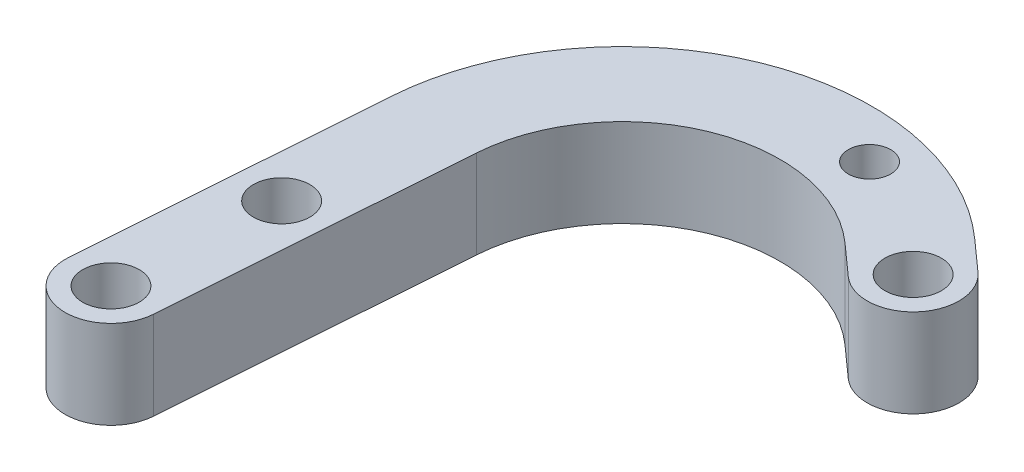
ISO-10303-21;
HEADER;
FILE_DESCRIPTION(('STEP AP214'),'2;1');
FILE_NAME('part.step','',(''),(''),'','','');
FILE_SCHEMA(('AUTOMOTIVE_DESIGN { 1 0 10303 214 1 1 1 1 }'));
ENDSEC;
DATA;
#1=APPLICATION_CONTEXT('core data for automotive mechanical design processes');
#2=APPLICATION_PROTOCOL_DEFINITION('international standard','automotive_design',2000,#1);
#3=PRODUCT_CONTEXT('',#1,'mechanical');
#4=PRODUCT('Part','Part','',(#3));
#5=PRODUCT_RELATED_PRODUCT_CATEGORY('part','',(#4));
#6=PRODUCT_DEFINITION_FORMATION('','',#4);
#7=PRODUCT_DEFINITION_CONTEXT('part definition',#1,'design');
#8=PRODUCT_DEFINITION('design','',#6,#7);
#9=PRODUCT_DEFINITION_SHAPE('','',#8);
#10=(LENGTH_UNIT() NAMED_UNIT(*) SI_UNIT(.MILLI.,.METRE.));
#11=(NAMED_UNIT(*) PLANE_ANGLE_UNIT() SI_UNIT($,.RADIAN.));
#12=(NAMED_UNIT(*) SI_UNIT($,.STERADIAN.) SOLID_ANGLE_UNIT());
#13=UNCERTAINTY_MEASURE_WITH_UNIT(LENGTH_MEASURE(1.E-05),#10,'distance_accuracy_value','');
#14=(GEOMETRIC_REPRESENTATION_CONTEXT(3) GLOBAL_UNCERTAINTY_ASSIGNED_CONTEXT((#13)) GLOBAL_UNIT_ASSIGNED_CONTEXT((#10,
#11,#12)) REPRESENTATION_CONTEXT('',''));
#15=CARTESIAN_POINT('',(0.,0.,0.));
#16=DIRECTION('',(0.,0.,1.));
#17=DIRECTION('',(1.,0.,0.));
#18=AXIS2_PLACEMENT_3D('',#15,#16,#17);
#19=CARTESIAN_POINT('',(-132.955581072489,25.,2.76572249161845));
#20=DIRECTION('',(0.,1.,0.));
#21=DIRECTION('',(0.,0.,1.));
#22=AXIS2_PLACEMENT_3D('',#19,#20,#21);
#23=PLANE('',#22);
#24=CARTESIAN_POINT('',(-129.654921113852,25.,-42.2342775083815));
#25=DIRECTION('',(0.,1.,0.));
#26=DIRECTION('',(0.,0.,1.));
#27=AXIS2_PLACEMENT_3D('',#24,#25,#26);
#28=CIRCLE('',#27,8.00000000000001);
#29=CARTESIAN_POINT('',(-129.654921113852,25.,-34.2342775083815));
#30=VERTEX_POINT('',#29);
#31=EDGE_CURVE('E233',#30,#30,#28,.T.);
#32=ORIENTED_EDGE('',*,*,#31,.F.);
#33=EDGE_LOOP('',(#32));
#34=FACE_BOUND('',#33,.T.);
#35=CARTESIAN_POINT('',(-56.0348957037398,25.,-134.982224643941));
#36=DIRECTION('',(0.,1.,0.));
#37=DIRECTION('',(0.,0.,1.));
#38=AXIS2_PLACEMENT_3D('',#35,#36,#37);
#39=CIRCLE('',#38,6.00000000000001);
#40=CARTESIAN_POINT('',(-56.0348957037398,25.,-128.982224643941));
#41=VERTEX_POINT('',#40);
#42=EDGE_CURVE('E229',#41,#41,#39,.T.);
#43=ORIENTED_EDGE('',*,*,#42,.F.);
#44=EDGE_LOOP('',(#43));
#45=FACE_BOUND('',#44,.T.);
#46=CARTESIAN_POINT('',(-132.955581072489,25.,2.76572249161845));
#47=DIRECTION('',(0.,1.,0.));
#48=DIRECTION('',(0.,0.,1.));
#49=AXIS2_PLACEMENT_3D('',#46,#47,#48);
#50=CIRCLE('',#49,7.99999999999998);
#51=CARTESIAN_POINT('',(-132.955581072489,25.,10.7657224916184));
#52=VERTEX_POINT('',#51);
#53=EDGE_CURVE('E146',#52,#52,#50,.T.);
#54=ORIENTED_EDGE('',*,*,#53,.F.);
#55=EDGE_LOOP('',(#54));
#56=FACE_BOUND('',#55,.T.);
#57=CARTESIAN_POINT('',(-132.955581072489,25.,2.76572249161845));
#58=DIRECTION('',(0.,1.,0.));
#59=DIRECTION('',(0.,0.,1.));
#60=AXIS2_PLACEMENT_3D('',#57,#58,#59);
#61=CIRCLE('',#60,13.);
#62=CARTESIAN_POINT('',(-145.921678768171,25.,1.82747383266902));
#63=VERTEX_POINT('',#62);
#64=CARTESIAN_POINT('',(-119.989483376807,25.,3.70397115056789));
#65=VERTEX_POINT('',#64);
#66=EDGE_CURVE('E164',#63,#65,#61,.T.);
#67=ORIENTED_EDGE('',*,*,#66,.T.);
#68=DIRECTION('',(0.0721729737653799,0.,-0.997392130437102));
#69=VECTOR('',#68,1.);
#70=CARTESIAN_POINT('',(-119.989483376807,25.,3.70397115056789));
#71=LINE('',#70,#69);
#72=CARTESIAN_POINT('',(-113.821309068904,25.,-81.5369187962164));
#73=VERTEX_POINT('',#72);
#74=EDGE_CURVE('E100',#65,#73,#71,.T.);
#75=ORIENTED_EDGE('',*,*,#74,.T.);
#76=CARTESIAN_POINT('',(-69.3125603452074,25.,-78.3161908037492));
#77=DIRECTION('',(0.,-1.,0.));
#78=DIRECTION('',(0.,0.,1.));
#79=AXIS2_PLACEMENT_3D('',#76,#77,#78);
#80=CIRCLE('',#79,44.6251252295228);
#81=CARTESIAN_POINT('',(-39.5827032102089,25.,-111.595875244609));
#82=VERTEX_POINT('',#81);
#83=EDGE_CURVE('E186',#73,#82,#80,.T.);
#84=ORIENTED_EDGE('',*,*,#83,.T.);
#85=DIRECTION('',(0.745761143967444,0.,0.666213416367735));
#86=VECTOR('',#85,1.);
#87=CARTESIAN_POINT('',(-39.5827032102089,25.,-111.595875244609));
#88=LINE('',#87,#86);
#89=CARTESIAN_POINT('',(-30.9204411137723,25.,-103.857586287854));
#90=VERTEX_POINT('',#89);
#91=EDGE_CURVE('E200',#82,#90,#88,.T.);
#92=ORIENTED_EDGE('',*,*,#91,.T.);
#93=CARTESIAN_POINT('',(-22.2596667009917,25.,-113.552481159431));
#94=DIRECTION('',(0.,1.,0.));
#95=DIRECTION('',(0.,0.,1.));
#96=AXIS2_PLACEMENT_3D('',#93,#94,#95);
#97=CIRCLE('',#96,13.);
#98=CARTESIAN_POINT('',(-13.5988922882111,25.,-123.247376031008));
#99=VERTEX_POINT('',#98);
#100=EDGE_CURVE('E119',#90,#99,#97,.T.);
#101=ORIENTED_EDGE('',*,*,#100,.T.);
#102=DIRECTION('',(-0.745761143967442,0.,-0.666213416367737));
#103=VECTOR('',#102,1.);
#104=CARTESIAN_POINT('',(-22.2611543846477,25.,-130.985664987762));
#105=LINE('',#104,#103);
#106=CARTESIAN_POINT('',(-22.2611543846478,25.,-130.985664987762));
#107=VERTEX_POINT('',#106);
#108=EDGE_CURVE('E113',#99,#107,#105,.T.);
#109=ORIENTED_EDGE('',*,*,#108,.T.);
#110=CARTESIAN_POINT('',(-69.3125603452074,25.,-78.3161908037492));
#111=DIRECTION('',(0.,1.,0.));
#112=DIRECTION('',(0.,0.,1.));
#113=AXIS2_PLACEMENT_3D('',#110,#111,#112);
#114=CIRCLE('',#113,70.6251252295228);
#115=CARTESIAN_POINT('',(-139.753504460268,25.,-83.4134161141162));
#116=VERTEX_POINT('',#115);
#117=EDGE_CURVE('E117',#107,#116,#114,.T.);
#118=ORIENTED_EDGE('',*,*,#117,.T.);
#119=DIRECTION('',(-0.0721729737653796,0.,0.997392130437102));
#120=VECTOR('',#119,1.);
#121=CARTESIAN_POINT('',(-145.921678768171,25.,1.82747383266902));
#122=LINE('',#121,#120);
#123=EDGE_CURVE('E57',#116,#63,#122,.T.);
#124=ORIENTED_EDGE('',*,*,#123,.T.);
#125=EDGE_LOOP('',(#67,#75,#84,#92,#101,#109,#118,#124));
#126=FACE_BOUND('',#125,.T.);
#127=CARTESIAN_POINT('',(-22.2596667009917,25.,-113.552481159431));
#128=DIRECTION('',(0.,1.,0.));
#129=DIRECTION('',(0.,0.,1.));
#130=AXIS2_PLACEMENT_3D('',#127,#128,#129);
#131=CIRCLE('',#130,8.0000000000002);
#132=CARTESIAN_POINT('',(-22.2596667009917,25.,-105.552481159431));
#133=VERTEX_POINT('',#132);
#134=EDGE_CURVE('E214',#133,#133,#131,.T.);
#135=ORIENTED_EDGE('',*,*,#134,.F.);
#136=EDGE_LOOP('',(#135));
#137=FACE_BOUND('',#136,.T.);
#138=ADVANCED_FACE('F38',(#34,#45,#56,#126,#137),#23,.T.);
#139=CARTESIAN_POINT('',(-132.955581072489,0.,2.76572249161845));
#140=DIRECTION('',(0.,1.,0.));
#141=DIRECTION('',(0.,0.,1.));
#142=AXIS2_PLACEMENT_3D('',#139,#140,#141);
#143=PLANE('',#142);
#144=CARTESIAN_POINT('',(-129.654921113852,0.,-42.2342775083815));
#145=DIRECTION('',(0.,1.,0.));
#146=DIRECTION('',(0.,0.,1.));
#147=AXIS2_PLACEMENT_3D('',#144,#145,#146);
#148=CIRCLE('',#147,8.00000000000001);
#149=CARTESIAN_POINT('',(-129.654921113852,0.,-34.2342775083815));
#150=VERTEX_POINT('',#149);
#151=EDGE_CURVE('E42',#150,#150,#148,.T.);
#152=ORIENTED_EDGE('',*,*,#151,.T.);
#153=EDGE_LOOP('',(#152));
#154=FACE_BOUND('',#153,.T.);
#155=CARTESIAN_POINT('',(-56.0348957037398,0.,-134.982224643941));
#156=DIRECTION('',(0.,1.,0.));
#157=DIRECTION('',(0.,0.,1.));
#158=AXIS2_PLACEMENT_3D('',#155,#156,#157);
#159=CIRCLE('',#158,6.00000000000001);
#160=CARTESIAN_POINT('',(-56.0348957037398,0.,-128.982224643941));
#161=VERTEX_POINT('',#160);
#162=EDGE_CURVE('E222',#161,#161,#159,.F.);
#163=ORIENTED_EDGE('',*,*,#162,.F.);
#164=EDGE_LOOP('',(#163));
#165=FACE_BOUND('',#164,.T.);
#166=CARTESIAN_POINT('',(-132.955581072489,0.,2.76572249161845));
#167=DIRECTION('',(0.,1.,0.));
#168=DIRECTION('',(0.,0.,1.));
#169=AXIS2_PLACEMENT_3D('',#166,#167,#168);
#170=CIRCLE('',#169,13.);
#171=CARTESIAN_POINT('',(-145.921678768171,0.,1.82747383266902));
#172=VERTEX_POINT('',#171);
#173=CARTESIAN_POINT('',(-119.989483376807,0.,3.70397115056789));
#174=VERTEX_POINT('',#173);
#175=EDGE_CURVE('E141',#172,#174,#170,.T.);
#176=ORIENTED_EDGE('',*,*,#175,.F.);
#177=DIRECTION('',(-0.0721729737653796,0.,0.997392130437102));
#178=VECTOR('',#177,1.);
#179=CARTESIAN_POINT('',(-145.921678768171,0.,1.82747383266902));
#180=LINE('',#179,#178);
#181=CARTESIAN_POINT('',(-139.753504460268,0.,-83.4134161141162));
#182=VERTEX_POINT('',#181);
#183=EDGE_CURVE('E92',#182,#172,#180,.T.);
#184=ORIENTED_EDGE('',*,*,#183,.F.);
#185=CARTESIAN_POINT('',(-69.3125603452074,0.,-78.3161908037492));
#186=DIRECTION('',(0.,1.,0.));
#187=DIRECTION('',(0.,0.,1.));
#188=AXIS2_PLACEMENT_3D('',#185,#186,#187);
#189=CIRCLE('',#188,70.6251252295228);
#190=CARTESIAN_POINT('',(-22.2611543846478,0.,-130.985664987762));
#191=VERTEX_POINT('',#190);
#192=EDGE_CURVE('E86',#191,#182,#189,.T.);
#193=ORIENTED_EDGE('',*,*,#192,.F.);
#194=DIRECTION('',(-0.745761143967442,0.,-0.666213416367737));
#195=VECTOR('',#194,1.);
#196=CARTESIAN_POINT('',(-22.2611543846477,0.,-130.985664987762));
#197=LINE('',#196,#195);
#198=CARTESIAN_POINT('',(-13.5988922882111,0.,-123.247376031008));
#199=VERTEX_POINT('',#198);
#200=EDGE_CURVE('E128',#199,#191,#197,.T.);
#201=ORIENTED_EDGE('',*,*,#200,.F.);
#202=CARTESIAN_POINT('',(-22.2596667009917,0.,-113.552481159431));
#203=DIRECTION('',(0.,1.,0.));
#204=DIRECTION('',(0.,0.,1.));
#205=AXIS2_PLACEMENT_3D('',#202,#203,#204);
#206=CIRCLE('',#205,13.);
#207=CARTESIAN_POINT('',(-30.9204411137723,0.,-103.857586287854));
#208=VERTEX_POINT('',#207);
#209=EDGE_CURVE('E155',#208,#199,#206,.T.);
#210=ORIENTED_EDGE('',*,*,#209,.F.);
#211=DIRECTION('',(0.745761143967444,0.,0.666213416367735));
#212=VECTOR('',#211,1.);
#213=CARTESIAN_POINT('',(-39.5827032102089,0.,-111.595875244609));
#214=LINE('',#213,#212);
#215=CARTESIAN_POINT('',(-39.5827032102089,0.,-111.595875244609));
#216=VERTEX_POINT('',#215);
#217=EDGE_CURVE('E152',#216,#208,#214,.T.);
#218=ORIENTED_EDGE('',*,*,#217,.F.);
#219=CARTESIAN_POINT('',(-69.3125603452074,0.,-78.3161908037492));
#220=DIRECTION('',(0.,-1.,0.));
#221=DIRECTION('',(0.,0.,1.));
#222=AXIS2_PLACEMENT_3D('',#219,#220,#221);
#223=CIRCLE('',#222,44.6251252295228);
#224=CARTESIAN_POINT('',(-113.821309068904,0.,-81.5369187962164));
#225=VERTEX_POINT('',#224);
#226=EDGE_CURVE('E149',#225,#216,#223,.T.);
#227=ORIENTED_EDGE('',*,*,#226,.F.);
#228=DIRECTION('',(0.0721729737653799,0.,-0.997392130437102));
#229=VECTOR('',#228,1.);
#230=CARTESIAN_POINT('',(-119.989483376807,0.,3.70397115056789));
#231=LINE('',#230,#229);
#232=EDGE_CURVE('E145',#174,#225,#231,.T.);
#233=ORIENTED_EDGE('',*,*,#232,.F.);
#234=EDGE_LOOP('',(#176,#184,#193,#201,#210,#218,#227,#233));
#235=FACE_BOUND('',#234,.T.);
#236=CARTESIAN_POINT('',(-132.955581072489,0.,2.76572249161845));
#237=DIRECTION('',(0.,1.,0.));
#238=DIRECTION('',(0.,0.,1.));
#239=AXIS2_PLACEMENT_3D('',#236,#237,#238);
#240=CIRCLE('',#239,7.99999999999998);
#241=CARTESIAN_POINT('',(-132.955581072489,0.,10.7657224916184));
#242=VERTEX_POINT('',#241);
#243=EDGE_CURVE('E210',#242,#242,#240,.T.);
#244=ORIENTED_EDGE('',*,*,#243,.T.);
#245=EDGE_LOOP('',(#244));
#246=FACE_BOUND('',#245,.T.);
#247=CARTESIAN_POINT('',(-22.2596667009917,0.,-113.552481159431));
#248=DIRECTION('',(0.,1.,0.));
#249=DIRECTION('',(0.,0.,1.));
#250=AXIS2_PLACEMENT_3D('',#247,#248,#249);
#251=CIRCLE('',#250,8.0000000000002);
#252=CARTESIAN_POINT('',(-22.2596667009917,0.,-105.552481159431));
#253=VERTEX_POINT('',#252);
#254=EDGE_CURVE('E218',#253,#253,#251,.T.);
#255=ORIENTED_EDGE('',*,*,#254,.T.);
#256=EDGE_LOOP('',(#255));
#257=FACE_BOUND('',#256,.T.);
#258=ADVANCED_FACE('F190',(#154,#165,#235,#246,#257),#143,.F.);
#259=CARTESIAN_POINT('',(-132.955581072489,25.,2.76572249161845));
#260=DIRECTION('',(0.,-1.,0.));
#261=DIRECTION('',(0.,0.,-1.));
#262=AXIS2_PLACEMENT_3D('',#259,#260,#261);
#263=CYLINDRICAL_SURFACE('',#262,13.);
#264=ORIENTED_EDGE('',*,*,#175,.T.);
#265=DIRECTION('',(0.,-1.,0.));
#266=VECTOR('',#265,1.);
#267=CARTESIAN_POINT('',(-119.989483376807,25.,3.70397115056789));
#268=LINE('',#267,#266);
#269=EDGE_CURVE('E11',#65,#174,#268,.T.);
#270=ORIENTED_EDGE('',*,*,#269,.F.);
#271=ORIENTED_EDGE('',*,*,#66,.F.);
#272=DIRECTION('',(0.,-1.,0.));
#273=VECTOR('',#272,1.);
#274=CARTESIAN_POINT('',(-145.921678768171,25.,1.82747383266902));
#275=LINE('',#274,#273);
#276=EDGE_CURVE('E137',#63,#172,#275,.T.);
#277=ORIENTED_EDGE('',*,*,#276,.T.);
#278=EDGE_LOOP('',(#264,#270,#271,#277));
#279=FACE_BOUND('',#278,.T.);
#280=ADVANCED_FACE('F40',(#279),#263,.T.);
#281=CARTESIAN_POINT('',(-119.989483376807,25.,3.70397115056789));
#282=DIRECTION('',(-0.997392130437102,0.,-0.0721729737653798));
#283=DIRECTION('',(-0.0721729737653799,0.,0.997392130437103));
#284=AXIS2_PLACEMENT_3D('',#281,#282,#283);
#285=PLANE('',#284);
#286=ORIENTED_EDGE('',*,*,#232,.T.);
#287=DIRECTION('',(0.,-1.,0.));
#288=VECTOR('',#287,1.);
#289=CARTESIAN_POINT('',(-113.821309068904,25.,-81.5369187962164));
#290=LINE('',#289,#288);
#291=EDGE_CURVE('E49',#73,#225,#290,.T.);
#292=ORIENTED_EDGE('',*,*,#291,.F.);
#293=ORIENTED_EDGE('',*,*,#74,.F.);
#294=ORIENTED_EDGE('',*,*,#269,.T.);
#295=EDGE_LOOP('',(#286,#292,#293,#294));
#296=FACE_BOUND('',#295,.T.);
#297=ADVANCED_FACE('F279',(#296),#285,.F.);
#298=CARTESIAN_POINT('',(-69.3125603452074,25.,-78.3161908037492));
#299=DIRECTION('',(0.,-1.,0.));
#300=DIRECTION('',(0.,0.,-1.));
#301=AXIS2_PLACEMENT_3D('',#298,#299,#300);
#302=CYLINDRICAL_SURFACE('',#301,44.6251252295228);
#303=ORIENTED_EDGE('',*,*,#226,.T.);
#304=DIRECTION('',(0.,-1.,0.));
#305=VECTOR('',#304,1.);
#306=CARTESIAN_POINT('',(-39.5827032102089,25.,-111.595875244609));
#307=LINE('',#306,#305);
#308=EDGE_CURVE('E175',#82,#216,#307,.T.);
#309=ORIENTED_EDGE('',*,*,#308,.F.);
#310=ORIENTED_EDGE('',*,*,#83,.F.);
#311=ORIENTED_EDGE('',*,*,#291,.T.);
#312=EDGE_LOOP('',(#303,#309,#310,#311));
#313=FACE_BOUND('',#312,.T.);
#314=ADVANCED_FACE('F184',(#313),#302,.F.);
#315=CARTESIAN_POINT('',(-39.5827032102089,25.,-111.595875244609));
#316=DIRECTION('',(0.666213416367735,0.,-0.745761143967444));
#317=DIRECTION('',(-0.745761143967444,0.,-0.666213416367735));
#318=AXIS2_PLACEMENT_3D('',#315,#316,#317);
#319=PLANE('',#318);
#320=ORIENTED_EDGE('',*,*,#217,.T.);
#321=DIRECTION('',(0.,-1.,0.));
#322=VECTOR('',#321,1.);
#323=CARTESIAN_POINT('',(-30.9204411137723,25.,-103.857586287854));
#324=LINE('',#323,#322);
#325=EDGE_CURVE('E171',#90,#208,#324,.T.);
#326=ORIENTED_EDGE('',*,*,#325,.F.);
#327=ORIENTED_EDGE('',*,*,#91,.F.);
#328=ORIENTED_EDGE('',*,*,#308,.T.);
#329=EDGE_LOOP('',(#320,#326,#327,#328));
#330=FACE_BOUND('',#329,.T.);
#331=ADVANCED_FACE('F195',(#330),#319,.F.);
#332=CARTESIAN_POINT('',(-22.2596667009917,25.,-113.552481159431));
#333=DIRECTION('',(0.,-1.,0.));
#334=DIRECTION('',(0.,0.,-1.));
#335=AXIS2_PLACEMENT_3D('',#332,#333,#334);
#336=CYLINDRICAL_SURFACE('',#335,13.);
#337=ORIENTED_EDGE('',*,*,#209,.T.);
#338=DIRECTION('',(0.,-1.,0.));
#339=VECTOR('',#338,1.);
#340=CARTESIAN_POINT('',(-13.5988922882111,25.,-123.247376031008));
#341=LINE('',#340,#339);
#342=EDGE_CURVE('E130',#99,#199,#341,.T.);
#343=ORIENTED_EDGE('',*,*,#342,.F.);
#344=ORIENTED_EDGE('',*,*,#100,.F.);
#345=ORIENTED_EDGE('',*,*,#325,.T.);
#346=EDGE_LOOP('',(#337,#343,#344,#345));
#347=FACE_BOUND('',#346,.T.);
#348=ADVANCED_FACE('F198',(#347),#336,.T.);
#349=CARTESIAN_POINT('',(-22.2611543846477,25.,-130.985664987762));
#350=DIRECTION('',(-0.666213416367737,0.,0.745761143967442));
#351=DIRECTION('',(0.745761143967442,0.,0.666213416367737));
#352=AXIS2_PLACEMENT_3D('',#349,#350,#351);
#353=PLANE('',#352);
#354=ORIENTED_EDGE('',*,*,#200,.T.);
#355=DIRECTION('',(0.,-1.,0.));
#356=VECTOR('',#355,1.);
#357=CARTESIAN_POINT('',(-22.2611543846478,25.,-130.985664987762));
#358=LINE('',#357,#356);
#359=EDGE_CURVE('E125',#107,#191,#358,.T.);
#360=ORIENTED_EDGE('',*,*,#359,.F.);
#361=ORIENTED_EDGE('',*,*,#108,.F.);
#362=ORIENTED_EDGE('',*,*,#342,.T.);
#363=EDGE_LOOP('',(#354,#360,#361,#362));
#364=FACE_BOUND('',#363,.T.);
#365=ADVANCED_FACE('F126',(#364),#353,.F.);
#366=CARTESIAN_POINT('',(-69.3125603452074,25.,-78.3161908037492));
#367=DIRECTION('',(0.,-1.,0.));
#368=DIRECTION('',(0.,0.,-1.));
#369=AXIS2_PLACEMENT_3D('',#366,#367,#368);
#370=CYLINDRICAL_SURFACE('',#369,70.6251252295228);
#371=ORIENTED_EDGE('',*,*,#192,.T.);
#372=DIRECTION('',(0.,-1.,0.));
#373=VECTOR('',#372,1.);
#374=CARTESIAN_POINT('',(-139.753504460268,25.,-83.4134161141162));
#375=LINE('',#374,#373);
#376=EDGE_CURVE('E131',#116,#182,#375,.T.);
#377=ORIENTED_EDGE('',*,*,#376,.F.);
#378=ORIENTED_EDGE('',*,*,#117,.F.);
#379=ORIENTED_EDGE('',*,*,#359,.T.);
#380=EDGE_LOOP('',(#371,#377,#378,#379));
#381=FACE_BOUND('',#380,.T.);
#382=ADVANCED_FACE('F133',(#381),#370,.T.);
#383=CARTESIAN_POINT('',(-145.921678768171,25.,1.82747383266902));
#384=DIRECTION('',(0.997392130437102,0.,0.0721729737653796));
#385=DIRECTION('',(0.0721729737653796,0.,-0.997392130437102));
#386=AXIS2_PLACEMENT_3D('',#383,#384,#385);
#387=PLANE('',#386);
#388=ORIENTED_EDGE('',*,*,#183,.T.);
#389=ORIENTED_EDGE('',*,*,#276,.F.);
#390=ORIENTED_EDGE('',*,*,#123,.F.);
#391=ORIENTED_EDGE('',*,*,#376,.T.);
#392=EDGE_LOOP('',(#388,#389,#390,#391));
#393=FACE_BOUND('',#392,.T.);
#394=ADVANCED_FACE('F267',(#393),#387,.F.);
#395=CARTESIAN_POINT('',(-132.955581072489,25.,2.76572249161845));
#396=DIRECTION('',(0.,-1.,0.));
#397=DIRECTION('',(0.,0.,-1.));
#398=AXIS2_PLACEMENT_3D('',#395,#396,#397);
#399=CYLINDRICAL_SURFACE('',#398,7.99999999999998);
#400=ORIENTED_EDGE('',*,*,#53,.T.);
#401=EDGE_LOOP('',(#400));
#402=FACE_BOUND('',#401,.T.);
#403=ORIENTED_EDGE('',*,*,#243,.F.);
#404=EDGE_LOOP('',(#403));
#405=FACE_BOUND('',#404,.T.);
#406=ADVANCED_FACE('F264',(#402,#405),#399,.F.);
#407=CARTESIAN_POINT('',(-22.2596667009917,25.,-113.552481159431));
#408=DIRECTION('',(0.,-1.,0.));
#409=DIRECTION('',(0.,0.,-1.));
#410=AXIS2_PLACEMENT_3D('',#407,#408,#409);
#411=CYLINDRICAL_SURFACE('',#410,8.0000000000002);
#412=ORIENTED_EDGE('',*,*,#134,.T.);
#413=EDGE_LOOP('',(#412));
#414=FACE_BOUND('',#413,.T.);
#415=ORIENTED_EDGE('',*,*,#254,.F.);
#416=EDGE_LOOP('',(#415));
#417=FACE_BOUND('',#416,.T.);
#418=ADVANCED_FACE('F251',(#414,#417),#411,.F.);
#419=CARTESIAN_POINT('',(-56.0348957037398,-16.9705627484772,-134.982224643941));
#420=DIRECTION('',(0.,1.,0.));
#421=DIRECTION('',(0.,0.,1.));
#422=AXIS2_PLACEMENT_3D('',#419,#420,#421);
#423=CYLINDRICAL_SURFACE('',#422,6.00000000000001);
#424=ORIENTED_EDGE('',*,*,#162,.T.);
#425=EDGE_LOOP('',(#424));
#426=FACE_BOUND('',#425,.T.);
#427=ORIENTED_EDGE('',*,*,#42,.T.);
#428=EDGE_LOOP('',(#427));
#429=FACE_BOUND('',#428,.T.);
#430=ADVANCED_FACE('F246',(#426,#429),#423,.F.);
#431=CARTESIAN_POINT('',(-129.654921113852,-1975.,-42.2342775083815));
#432=DIRECTION('',(0.,1.,0.));
#433=DIRECTION('',(0.,0.,1.));
#434=AXIS2_PLACEMENT_3D('',#431,#432,#433);
#435=CYLINDRICAL_SURFACE('',#434,8.00000000000001);
#436=ORIENTED_EDGE('',*,*,#31,.T.);
#437=EDGE_LOOP('',(#436));
#438=FACE_BOUND('',#437,.T.);
#439=ORIENTED_EDGE('',*,*,#151,.F.);
#440=EDGE_LOOP('',(#439));
#441=FACE_BOUND('',#440,.T.);
#442=ADVANCED_FACE('F244',(#438,#441),#435,.F.);
#443=CLOSED_SHELL('',(#138,#258,#280,#297,#314,#331,#348,#365,#382,#394,#406,#418,#430,#442));
#444=MANIFOLD_SOLID_BREP('B2',#443);
#445=ADVANCED_BREP_SHAPE_REPRESENTATION('',(#18,#444),#14);
#446=SHAPE_DEFINITION_REPRESENTATION(#9,#445);
ENDSEC;
END-ISO-10303-21;
